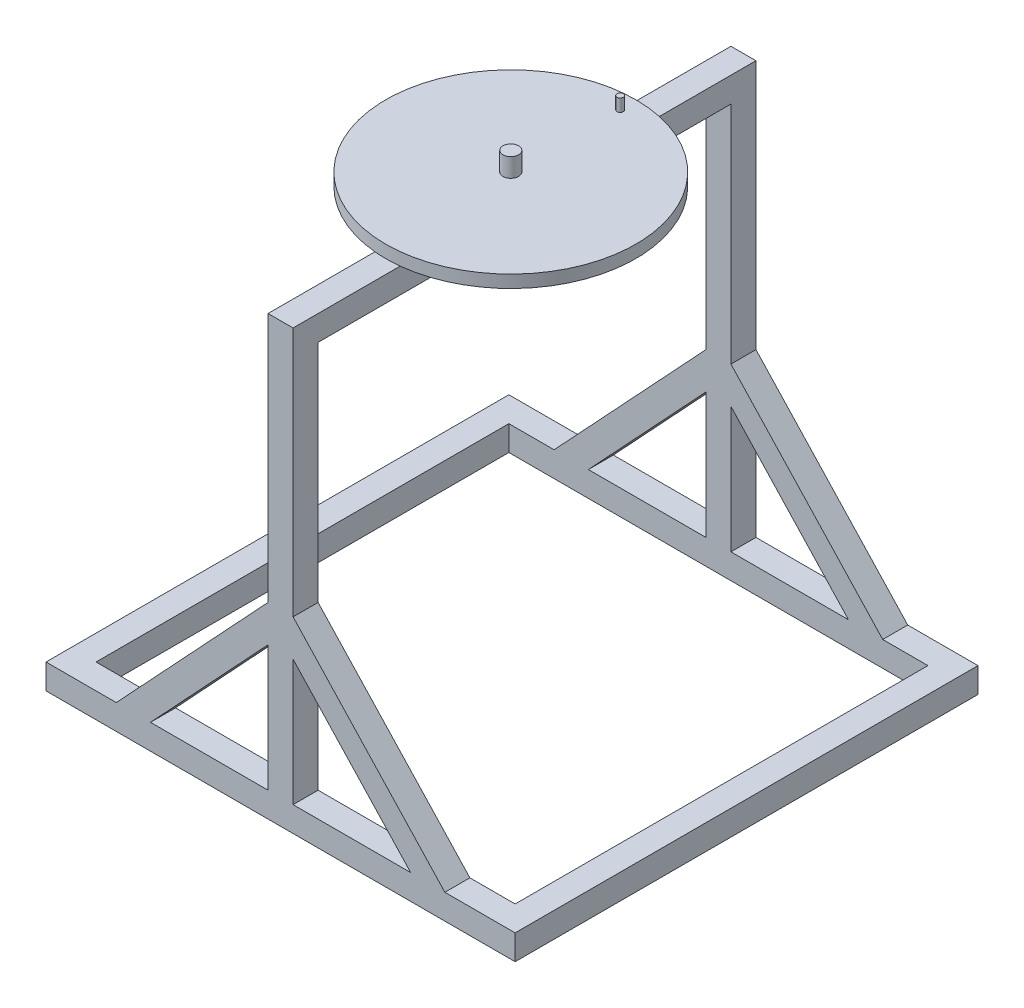
ISO-10303-21;
HEADER;
FILE_DESCRIPTION(('STEP AP214'),'2;1');
FILE_NAME('part.step','',(''),(''),'','','');
FILE_SCHEMA(('AUTOMOTIVE_DESIGN { 1 0 10303 214 1 1 1 1 }'));
ENDSEC;
DATA;
#1=APPLICATION_CONTEXT('core data for automotive mechanical design processes');
#2=APPLICATION_PROTOCOL_DEFINITION('international standard','automotive_design',2000,#1);
#3=PRODUCT_CONTEXT('',#1,'mechanical');
#4=PRODUCT('Part','Part','',(#3));
#5=PRODUCT_RELATED_PRODUCT_CATEGORY('part','',(#4));
#6=PRODUCT_DEFINITION_FORMATION('','',#4);
#7=PRODUCT_DEFINITION_CONTEXT('part definition',#1,'design');
#8=PRODUCT_DEFINITION('design','',#6,#7);
#9=PRODUCT_DEFINITION_SHAPE('','',#8);
#10=(LENGTH_UNIT() NAMED_UNIT(*) SI_UNIT(.MILLI.,.METRE.));
#11=(NAMED_UNIT(*) PLANE_ANGLE_UNIT() SI_UNIT($,.RADIAN.));
#12=(NAMED_UNIT(*) SI_UNIT($,.STERADIAN.) SOLID_ANGLE_UNIT());
#13=UNCERTAINTY_MEASURE_WITH_UNIT(LENGTH_MEASURE(1.E-05),#10,'distance_accuracy_value','');
#14=(GEOMETRIC_REPRESENTATION_CONTEXT(3) GLOBAL_UNCERTAINTY_ASSIGNED_CONTEXT((#13)) GLOBAL_UNIT_ASSIGNED_CONTEXT((#10,
#11,#12)) REPRESENTATION_CONTEXT('',''));
#15=CARTESIAN_POINT('',(0.,0.,0.));
#16=DIRECTION('',(0.,0.,1.));
#17=DIRECTION('',(1.,0.,0.));
#18=AXIS2_PLACEMENT_3D('',#15,#16,#17);
#19=CARTESIAN_POINT('',(0.,173.509933774834,740.));
#20=DIRECTION('',(0.,1.,0.));
#21=DIRECTION('',(0.,0.,1.));
#22=AXIS2_PLACEMENT_3D('',#19,#20,#21);
#23=PLANE('',#22);
#24=CARTESIAN_POINT('',(-61.4033289403528,173.509933774834,370.));
#25=DIRECTION('',(0.,1.,0.));
#26=DIRECTION('',(0.,0.,1.));
#27=AXIS2_PLACEMENT_3D('',#24,#25,#26);
#28=CIRCLE('',#27,200.);
#29=CARTESIAN_POINT('',(-39.4701986754966,173.509933774834,171.206293367258));
#30=VERTEX_POINT('',#29);
#31=CARTESIAN_POINT('',(-79.4701986754966,173.509933774834,170.817701042554));
#32=VERTEX_POINT('',#31);
#33=EDGE_CURVE('E11',#30,#32,#28,.T.);
#34=ORIENTED_EDGE('',*,*,#33,.F.);
#35=DIRECTION('',(0.,0.,-1.));
#36=VECTOR('',#35,1.);
#37=CARTESIAN_POINT('',(-39.4701986754966,173.509933774834,740.));
#38=LINE('',#37,#36);
#39=CARTESIAN_POINT('',(-39.4701986754966,173.509933774834,0.));
#40=VERTEX_POINT('',#39);
#41=EDGE_CURVE('E266',#30,#40,#38,.T.);
#42=ORIENTED_EDGE('',*,*,#41,.T.);
#43=DIRECTION('',(1.,0.,0.));
#44=VECTOR('',#43,1.);
#45=CARTESIAN_POINT('',(0.,173.509933774834,0.));
#46=LINE('',#45,#44);
#47=CARTESIAN_POINT('',(-79.4701986754966,173.509933774834,0.));
#48=VERTEX_POINT('',#47);
#49=EDGE_CURVE('E425',#48,#40,#46,.T.);
#50=ORIENTED_EDGE('',*,*,#49,.F.);
#51=DIRECTION('',(0.,0.,-1.));
#52=VECTOR('',#51,1.);
#53=CARTESIAN_POINT('',(-79.4701986754966,173.509933774834,740.));
#54=LINE('',#53,#52);
#55=EDGE_CURVE('E55',#32,#48,#54,.T.);
#56=ORIENTED_EDGE('',*,*,#55,.F.);
#57=EDGE_LOOP('',(#34,#42,#50,#56));
#58=FACE_BOUND('',#57,.T.);
#59=ADVANCED_FACE('F34',(#58),#23,.T.);
#60=CARTESIAN_POINT('',(0.,-486.490066225165,740.));
#61=DIRECTION('',(0.,-1.,0.));
#62=DIRECTION('',(0.,0.,-1.));
#63=AXIS2_PLACEMENT_3D('',#60,#61,#62);
#64=PLANE('',#63);
#65=DIRECTION('',(0.,0.,-1.));
#66=VECTOR('',#65,1.);
#67=CARTESIAN_POINT('',(-79.4701986754965,-486.490066225165,740.));
#68=LINE('',#67,#66);
#69=CARTESIAN_POINT('',(-79.4701986754965,-486.490066225165,740.));
#70=VERTEX_POINT('',#69);
#71=CARTESIAN_POINT('',(-79.4701986754965,-486.490066225165,700.));
#72=VERTEX_POINT('',#71);
#73=EDGE_CURVE('E459',#70,#72,#68,.T.);
#74=ORIENTED_EDGE('',*,*,#73,.T.);
#75=DIRECTION('',(-1.,0.,0.));
#76=VECTOR('',#75,1.);
#77=CARTESIAN_POINT('',(0.,-486.490066225165,700.));
#78=LINE('',#77,#76);
#79=CARTESIAN_POINT('',(-267.421439932341,-486.490066225165,700.));
#80=VERTEX_POINT('',#79);
#81=EDGE_CURVE('E365',#72,#80,#78,.T.);
#82=ORIENTED_EDGE('',*,*,#81,.T.);
#83=DIRECTION('',(0.,0.,-1.));
#84=VECTOR('',#83,1.);
#85=CARTESIAN_POINT('',(-267.421439932341,-486.490066225165,740.));
#86=LINE('',#85,#84);
#87=CARTESIAN_POINT('',(-267.421439932341,-486.490066225165,740.));
#88=VERTEX_POINT('',#87);
#89=EDGE_CURVE('E468',#88,#80,#86,.T.);
#90=ORIENTED_EDGE('',*,*,#89,.F.);
#91=DIRECTION('',(-1.,0.,0.));
#92=VECTOR('',#91,1.);
#93=CARTESIAN_POINT('',(0.,-486.490066225165,740.));
#94=LINE('',#93,#92);
#95=EDGE_CURVE('E416',#70,#88,#94,.T.);
#96=ORIENTED_EDGE('',*,*,#95,.F.);
#97=EDGE_LOOP('',(#74,#82,#90,#96));
#98=FACE_BOUND('',#97,.T.);
#99=ADVANCED_FACE('F597',(#98),#64,.F.);
#100=CARTESIAN_POINT('',(99.7460568230592,-93.096319701522,740.));
#101=DIRECTION('',(-0.731055268242869,0.682318250360011,0.));
#102=DIRECTION('',(-0.682318250360011,-0.731055268242869,0.));
#103=AXIS2_PLACEMENT_3D('',#100,#101,#102);
#104=PLANE('',#103);
#105=ORIENTED_EDGE('',*,*,#89,.T.);
#106=DIRECTION('',(0.682318250360011,0.731055268242869,0.));
#107=VECTOR('',#106,1.);
#108=CARTESIAN_POINT('',(99.7460568230592,-93.096319701522,700.));
#109=LINE('',#108,#107);
#110=CARTESIAN_POINT('',(-79.4701986754965,-285.113736307117,700.));
#111=VERTEX_POINT('',#110);
#112=EDGE_CURVE('E362',#80,#111,#109,.T.);
#113=ORIENTED_EDGE('',*,*,#112,.T.);
#114=DIRECTION('',(0.,0.,-1.));
#115=VECTOR('',#114,1.);
#116=CARTESIAN_POINT('',(-79.4701986754965,-285.113736307117,740.));
#117=LINE('',#116,#115);
#118=CARTESIAN_POINT('',(-79.4701986754965,-285.113736307117,740.));
#119=VERTEX_POINT('',#118);
#120=EDGE_CURVE('E464',#119,#111,#117,.T.);
#121=ORIENTED_EDGE('',*,*,#120,.F.);
#122=DIRECTION('',(0.682318250360011,0.731055268242869,0.));
#123=VECTOR('',#122,1.);
#124=CARTESIAN_POINT('',(99.7460568230592,-93.096319701522,740.));
#125=LINE('',#124,#123);
#126=EDGE_CURVE('E419',#88,#119,#125,.T.);
#127=ORIENTED_EDGE('',*,*,#126,.F.);
#128=EDGE_LOOP('',(#105,#113,#121,#127));
#129=FACE_BOUND('',#128,.T.);
#130=ADVANCED_FACE('F601',(#129),#104,.F.);
#131=CARTESIAN_POINT('',(-163.31277749758,-152.425258997742,740.));
#132=DIRECTION('',(-0.731055268242869,-0.682318250360011,0.));
#133=DIRECTION('',(0.682318250360011,-0.731055268242869,0.));
#134=AXIS2_PLACEMENT_3D('',#131,#132,#133);
#135=PLANE('',#134);
#136=DIRECTION('',(-0.682318250360011,0.731055268242869,0.));
#137=VECTOR('',#136,1.);
#138=CARTESIAN_POINT('',(-163.31277749758,-152.425258997742,700.));
#139=LINE('',#138,#137);
#140=CARTESIAN_POINT('',(148.481042581348,-486.490066225165,700.));
#141=VERTEX_POINT('',#140);
#142=CARTESIAN_POINT('',(-39.4701986754965,-285.113736307117,700.));
#143=VERTEX_POINT('',#142);
#144=EDGE_CURVE('E387',#141,#143,#139,.T.);
#145=ORIENTED_EDGE('',*,*,#144,.F.);
#146=DIRECTION('',(0.,0.,-1.));
#147=VECTOR('',#146,1.);
#148=CARTESIAN_POINT('',(148.481042581348,-486.490066225165,740.));
#149=LINE('',#148,#147);
#150=CARTESIAN_POINT('',(148.481042581348,-486.490066225165,740.));
#151=VERTEX_POINT('',#150);
#152=EDGE_CURVE('E480',#151,#141,#149,.T.);
#153=ORIENTED_EDGE('',*,*,#152,.F.);
#154=DIRECTION('',(-0.682318250360011,0.731055268242869,0.));
#155=VECTOR('',#154,1.);
#156=CARTESIAN_POINT('',(-163.31277749758,-152.425258997742,740.));
#157=LINE('',#156,#155);
#158=CARTESIAN_POINT('',(-39.4701986754965,-285.113736307117,740.));
#159=VERTEX_POINT('',#158);
#160=EDGE_CURVE('E408',#151,#159,#157,.T.);
#161=ORIENTED_EDGE('',*,*,#160,.T.);
#162=DIRECTION('',(0.,0.,-1.));
#163=VECTOR('',#162,1.);
#164=CARTESIAN_POINT('',(-39.4701986754965,-285.113736307117,740.));
#165=LINE('',#164,#163);
#166=EDGE_CURVE('E472',#159,#143,#165,.T.);
#167=ORIENTED_EDGE('',*,*,#166,.T.);
#168=EDGE_LOOP('',(#145,#153,#161,#167));
#169=FACE_BOUND('',#168,.T.);
#170=ADVANCED_FACE('F625',(#169),#135,.T.);
#171=CARTESIAN_POINT('',(0.,-486.490066225165,740.));
#172=DIRECTION('',(0.,-1.,0.));
#173=DIRECTION('',(0.,0.,-1.));
#174=AXIS2_PLACEMENT_3D('',#171,#172,#173);
#175=PLANE('',#174);
#176=ORIENTED_EDGE('',*,*,#152,.T.);
#177=DIRECTION('',(-1.,0.,0.));
#178=VECTOR('',#177,1.);
#179=CARTESIAN_POINT('',(0.,-486.490066225165,700.));
#180=LINE('',#179,#178);
#181=CARTESIAN_POINT('',(-39.4701986754965,-486.490066225165,700.));
#182=VERTEX_POINT('',#181);
#183=EDGE_CURVE('E384',#141,#182,#180,.T.);
#184=ORIENTED_EDGE('',*,*,#183,.T.);
#185=DIRECTION('',(0.,0.,-1.));
#186=VECTOR('',#185,1.);
#187=CARTESIAN_POINT('',(-39.4701986754965,-486.490066225165,740.));
#188=LINE('',#187,#186);
#189=CARTESIAN_POINT('',(-39.4701986754965,-486.490066225165,740.));
#190=VERTEX_POINT('',#189);
#191=EDGE_CURVE('E476',#190,#182,#188,.T.);
#192=ORIENTED_EDGE('',*,*,#191,.F.);
#193=DIRECTION('',(-1.,0.,0.));
#194=VECTOR('',#193,1.);
#195=CARTESIAN_POINT('',(0.,-486.490066225165,740.));
#196=LINE('',#195,#194);
#197=EDGE_CURVE('E411',#151,#190,#196,.T.);
#198=ORIENTED_EDGE('',*,*,#197,.F.);
#199=EDGE_LOOP('',(#176,#184,#192,#198));
#200=FACE_BOUND('',#199,.T.);
#201=ADVANCED_FACE('F618',(#200),#175,.F.);
#202=CARTESIAN_POINT('',(70.5038460933445,-65.8035896871215,740.));
#203=DIRECTION('',(-0.731055268242869,0.682318250360011,0.));
#204=DIRECTION('',(-0.682318250360011,-0.731055268242869,0.));
#205=AXIS2_PLACEMENT_3D('',#202,#203,#204);
#206=PLANE('',#205);
#207=DIRECTION('',(0.682318250360011,0.731055268242869,0.));
#208=VECTOR('',#207,1.);
#209=CARTESIAN_POINT('',(70.5038460933445,-65.8035896871215,700.));
#210=LINE('',#209,#208);
#211=CARTESIAN_POINT('',(-322.136865342163,-486.490066225165,700.));
#212=VERTEX_POINT('',#211);
#213=CARTESIAN_POINT('',(-79.4701986754965,-226.490066225165,700.));
#214=VERTEX_POINT('',#213);
#215=EDGE_CURVE('E377',#212,#214,#210,.T.);
#216=ORIENTED_EDGE('',*,*,#215,.F.);
#217=DIRECTION('',(0.,0.,-1.));
#218=VECTOR('',#217,1.);
#219=CARTESIAN_POINT('',(-322.136865342163,-486.490066225165,740.));
#220=LINE('',#219,#218);
#221=CARTESIAN_POINT('',(-322.136865342163,-486.490066225165,740.));
#222=VERTEX_POINT('',#221);
#223=EDGE_CURVE('E491',#222,#212,#220,.T.);
#224=ORIENTED_EDGE('',*,*,#223,.F.);
#225=DIRECTION('',(0.682318250360011,0.731055268242869,0.));
#226=VECTOR('',#225,1.);
#227=CARTESIAN_POINT('',(70.5038460933445,-65.8035896871215,740.));
#228=LINE('',#227,#226);
#229=CARTESIAN_POINT('',(-79.4701986754965,-226.490066225165,740.));
#230=VERTEX_POINT('',#229);
#231=EDGE_CURVE('E396',#222,#230,#228,.T.);
#232=ORIENTED_EDGE('',*,*,#231,.T.);
#233=DIRECTION('',(0.,0.,-1.));
#234=VECTOR('',#233,1.);
#235=CARTESIAN_POINT('',(-79.4701986754965,-226.490066225165,740.));
#236=LINE('',#235,#234);
#237=EDGE_CURVE('E495',#230,#214,#236,.T.);
#238=ORIENTED_EDGE('',*,*,#237,.T.);
#239=EDGE_LOOP('',(#216,#224,#232,#238));
#240=FACE_BOUND('',#239,.T.);
#241=ADVANCED_FACE('F576',(#240),#206,.T.);
#242=CARTESIAN_POINT('',(-39.4701986754966,0.,740.));
#243=DIRECTION('',(1.,0.,0.));
#244=DIRECTION('',(0.,1.,0.));
#245=AXIS2_PLACEMENT_3D('',#242,#243,#244);
#246=PLANE('',#245);
#247=DIRECTION('',(0.,-1.,0.));
#248=VECTOR('',#247,1.);
#249=CARTESIAN_POINT('',(-39.4701986754966,0.,700.));
#250=LINE('',#249,#248);
#251=EDGE_CURVE('E382',#143,#182,#250,.T.);
#252=ORIENTED_EDGE('',*,*,#251,.F.);
#253=ORIENTED_EDGE('',*,*,#166,.F.);
#254=DIRECTION('',(0.,-1.,0.));
#255=VECTOR('',#254,1.);
#256=CARTESIAN_POINT('',(-39.4701986754966,0.,740.));
#257=LINE('',#256,#255);
#258=EDGE_CURVE('E413',#159,#190,#257,.T.);
#259=ORIENTED_EDGE('',*,*,#258,.T.);
#260=ORIENTED_EDGE('',*,*,#191,.T.);
#261=EDGE_LOOP('',(#252,#253,#259,#260));
#262=FACE_BOUND('',#261,.T.);
#263=ADVANCED_FACE('F634',(#262),#246,.T.);
#264=CARTESIAN_POINT('',(-134.070566767866,-125.132528983341,740.));
#265=DIRECTION('',(-0.731055268242869,-0.682318250360011,0.));
#266=DIRECTION('',(0.682318250360011,-0.731055268242869,0.));
#267=AXIS2_PLACEMENT_3D('',#264,#265,#266);
#268=PLANE('',#267);
#269=DIRECTION('',(0.,0.,-1.));
#270=VECTOR('',#269,1.);
#271=CARTESIAN_POINT('',(203.19646799117,-486.490066225165,740.));
#272=LINE('',#271,#270);
#273=CARTESIAN_POINT('',(203.19646799117,-486.490066225165,740.));
#274=VERTEX_POINT('',#273);
#275=CARTESIAN_POINT('',(203.19646799117,-486.490066225165,700.));
#276=VERTEX_POINT('',#275);
#277=EDGE_CURVE('E487',#274,#276,#272,.T.);
#278=ORIENTED_EDGE('',*,*,#277,.T.);
#279=DIRECTION('',(-0.682318250360011,0.731055268242869,0.));
#280=VECTOR('',#279,1.);
#281=CARTESIAN_POINT('',(-134.070566767866,-125.132528983341,700.));
#282=LINE('',#281,#280);
#283=CARTESIAN_POINT('',(-39.4701986754966,-226.490066225165,700.));
#284=VERTEX_POINT('',#283);
#285=EDGE_CURVE('E368',#276,#284,#282,.T.);
#286=ORIENTED_EDGE('',*,*,#285,.T.);
#287=DIRECTION('',(0.,0.,-1.));
#288=VECTOR('',#287,1.);
#289=CARTESIAN_POINT('',(-39.4701986754966,-226.490066225165,740.));
#290=LINE('',#289,#288);
#291=CARTESIAN_POINT('',(-39.4701986754966,-226.490066225165,740.));
#292=VERTEX_POINT('',#291);
#293=EDGE_CURVE('E483',#292,#284,#290,.T.);
#294=ORIENTED_EDGE('',*,*,#293,.F.);
#295=DIRECTION('',(-0.682318250360011,0.731055268242869,0.));
#296=VECTOR('',#295,1.);
#297=CARTESIAN_POINT('',(-134.070566767866,-125.132528983341,740.));
#298=LINE('',#297,#296);
#299=EDGE_CURVE('E405',#274,#292,#298,.T.);
#300=ORIENTED_EDGE('',*,*,#299,.F.);
#301=EDGE_LOOP('',(#278,#286,#294,#300));
#302=FACE_BOUND('',#301,.T.);
#303=ADVANCED_FACE('F585',(#302),#268,.F.);
#304=CARTESIAN_POINT('',(-79.4701986754966,0.,740.));
#305=DIRECTION('',(1.,0.,0.));
#306=DIRECTION('',(0.,1.,0.));
#307=AXIS2_PLACEMENT_3D('',#304,#305,#306);
#308=PLANE('',#307);
#309=ORIENTED_EDGE('',*,*,#120,.T.);
#310=DIRECTION('',(0.,-1.,0.));
#311=VECTOR('',#310,1.);
#312=CARTESIAN_POINT('',(-79.4701986754966,0.,700.));
#313=LINE('',#312,#311);
#314=EDGE_CURVE('E503',#111,#72,#313,.T.);
#315=ORIENTED_EDGE('',*,*,#314,.T.);
#316=ORIENTED_EDGE('',*,*,#73,.F.);
#317=DIRECTION('',(0.,-1.,0.));
#318=VECTOR('',#317,1.);
#319=CARTESIAN_POINT('',(-79.4701986754966,0.,740.));
#320=LINE('',#319,#318);
#321=EDGE_CURVE('E421',#119,#70,#320,.T.);
#322=ORIENTED_EDGE('',*,*,#321,.F.);
#323=EDGE_LOOP('',(#309,#315,#316,#322));
#324=FACE_BOUND('',#323,.T.);
#325=ADVANCED_FACE('F656',(#324),#308,.F.);
#326=CARTESIAN_POINT('',(-267.421439932341,-486.490066225165,40.));
#327=VERTEX_POINT('',#326);
#328=CARTESIAN_POINT('',(-267.421439932341,-486.490066225165,0.));
#329=VERTEX_POINT('',#328);
#330=EDGE_CURVE('E467',#327,#329,#86,.T.);
#331=ORIENTED_EDGE('',*,*,#330,.F.);
#332=DIRECTION('',(1.,0.,0.));
#333=VECTOR('',#332,1.);
#334=CARTESIAN_POINT('',(0.,-486.490066225165,40.));
#335=LINE('',#334,#333);
#336=CARTESIAN_POINT('',(-79.4701986754965,-486.490066225165,40.));
#337=VERTEX_POINT('',#336);
#338=EDGE_CURVE('E336',#327,#337,#335,.T.);
#339=ORIENTED_EDGE('',*,*,#338,.T.);
#340=CARTESIAN_POINT('',(-79.4701986754965,-486.490066225165,0.));
#341=VERTEX_POINT('',#340);
#342=EDGE_CURVE('E463',#337,#341,#68,.T.);
#343=ORIENTED_EDGE('',*,*,#342,.T.);
#344=DIRECTION('',(-1.,0.,0.));
#345=VECTOR('',#344,1.);
#346=CARTESIAN_POINT('',(0.,-486.490066225165,0.));
#347=LINE('',#346,#345);
#348=EDGE_CURVE('E451',#341,#329,#347,.T.);
#349=ORIENTED_EDGE('',*,*,#348,.T.);
#350=EDGE_LOOP('',(#331,#339,#343,#349));
#351=FACE_BOUND('',#350,.T.);
#352=ADVANCED_FACE('F604',(#351),#64,.F.);
#353=CARTESIAN_POINT('',(-79.4701986754965,-285.113736307117,40.));
#354=VERTEX_POINT('',#353);
#355=CARTESIAN_POINT('',(-79.4701986754965,-285.113736307117,0.));
#356=VERTEX_POINT('',#355);
#357=EDGE_CURVE('E462',#354,#356,#117,.T.);
#358=ORIENTED_EDGE('',*,*,#357,.F.);
#359=DIRECTION('',(-0.682318250360011,-0.731055268242869,0.));
#360=VECTOR('',#359,1.);
#361=CARTESIAN_POINT('',(99.7460568230592,-93.096319701522,40.));
#362=LINE('',#361,#360);
#363=EDGE_CURVE('E333',#354,#327,#362,.T.);
#364=ORIENTED_EDGE('',*,*,#363,.T.);
#365=ORIENTED_EDGE('',*,*,#330,.T.);
#366=DIRECTION('',(0.682318250360011,0.731055268242869,0.));
#367=VECTOR('',#366,1.);
#368=CARTESIAN_POINT('',(99.7460568230592,-93.096319701522,0.));
#369=LINE('',#368,#367);
#370=EDGE_CURVE('E454',#329,#356,#369,.T.);
#371=ORIENTED_EDGE('',*,*,#370,.T.);
#372=EDGE_LOOP('',(#358,#364,#365,#371));
#373=FACE_BOUND('',#372,.T.);
#374=ADVANCED_FACE('F622',(#373),#104,.F.);
#375=DIRECTION('',(0.682318250360011,-0.731055268242869,0.));
#376=VECTOR('',#375,1.);
#377=CARTESIAN_POINT('',(-163.31277749758,-152.425258997742,40.));
#378=LINE('',#377,#376);
#379=CARTESIAN_POINT('',(-39.4701986754965,-285.113736307117,40.));
#380=VERTEX_POINT('',#379);
#381=CARTESIAN_POINT('',(148.481042581348,-486.490066225165,40.));
#382=VERTEX_POINT('',#381);
#383=EDGE_CURVE('E360',#380,#382,#378,.T.);
#384=ORIENTED_EDGE('',*,*,#383,.F.);
#385=CARTESIAN_POINT('',(-39.4701986754965,-285.113736307117,0.));
#386=VERTEX_POINT('',#385);
#387=EDGE_CURVE('E263',#380,#386,#165,.T.);
#388=ORIENTED_EDGE('',*,*,#387,.T.);
#389=DIRECTION('',(-0.682318250360011,0.731055268242869,0.));
#390=VECTOR('',#389,1.);
#391=CARTESIAN_POINT('',(-163.31277749758,-152.425258997742,0.));
#392=LINE('',#391,#390);
#393=CARTESIAN_POINT('',(148.481042581348,-486.490066225165,0.));
#394=VERTEX_POINT('',#393);
#395=EDGE_CURVE('E442',#394,#386,#392,.T.);
#396=ORIENTED_EDGE('',*,*,#395,.F.);
#397=EDGE_CURVE('E479',#382,#394,#149,.T.);
#398=ORIENTED_EDGE('',*,*,#397,.F.);
#399=EDGE_LOOP('',(#384,#388,#396,#398));
#400=FACE_BOUND('',#399,.T.);
#401=ADVANCED_FACE('F615',(#400),#135,.T.);
#402=CARTESIAN_POINT('',(-39.4701986754965,-486.490066225165,40.));
#403=VERTEX_POINT('',#402);
#404=CARTESIAN_POINT('',(-39.4701986754965,-486.490066225165,0.));
#405=VERTEX_POINT('',#404);
#406=EDGE_CURVE('E475',#403,#405,#188,.T.);
#407=ORIENTED_EDGE('',*,*,#406,.F.);
#408=DIRECTION('',(1.,0.,0.));
#409=VECTOR('',#408,1.);
#410=CARTESIAN_POINT('',(0.,-486.490066225165,40.));
#411=LINE('',#410,#409);
#412=EDGE_CURVE('E357',#403,#382,#411,.T.);
#413=ORIENTED_EDGE('',*,*,#412,.T.);
#414=ORIENTED_EDGE('',*,*,#397,.T.);
#415=DIRECTION('',(-1.,0.,0.));
#416=VECTOR('',#415,1.);
#417=CARTESIAN_POINT('',(0.,-486.490066225165,0.));
#418=LINE('',#417,#416);
#419=EDGE_CURVE('E445',#394,#405,#418,.T.);
#420=ORIENTED_EDGE('',*,*,#419,.T.);
#421=EDGE_LOOP('',(#407,#413,#414,#420));
#422=FACE_BOUND('',#421,.T.);
#423=ADVANCED_FACE('F611',(#422),#175,.F.);
#424=CARTESIAN_POINT('',(-39.4701986754966,0.,740.));
#425=DIRECTION('',(1.,0.,0.));
#426=DIRECTION('',(0.,1.,0.));
#427=AXIS2_PLACEMENT_3D('',#424,#425,#426);
#428=PLANE('',#427);
#429=CARTESIAN_POINT('',(-39.4701986754966,-226.490066225165,40.));
#430=VERTEX_POINT('',#429);
#431=CARTESIAN_POINT('',(-39.4701986754966,-226.490066225165,0.));
#432=VERTEX_POINT('',#431);
#433=EDGE_CURVE('E423',#430,#432,#290,.T.);
#434=ORIENTED_EDGE('',*,*,#433,.T.);
#435=DIRECTION('',(0.,-1.,0.));
#436=VECTOR('',#435,1.);
#437=CARTESIAN_POINT('',(-39.4701986754966,0.,0.));
#438=LINE('',#437,#436);
#439=EDGE_CURVE('E389',#40,#432,#438,.T.);
#440=ORIENTED_EDGE('',*,*,#439,.F.);
#441=ORIENTED_EDGE('',*,*,#41,.F.);
#442=CARTESIAN_POINT('',(-39.4701986754966,173.509933774834,568.793706632742));
#443=VERTEX_POINT('',#442);
#444=EDGE_CURVE('E264',#443,#30,#38,.T.);
#445=ORIENTED_EDGE('',*,*,#444,.F.);
#446=CARTESIAN_POINT('',(-39.4701986754966,173.509933774834,740.));
#447=VERTEX_POINT('',#446);
#448=EDGE_CURVE('E254',#447,#443,#38,.T.);
#449=ORIENTED_EDGE('',*,*,#448,.F.);
#450=DIRECTION('',(0.,-1.,0.));
#451=VECTOR('',#450,1.);
#452=CARTESIAN_POINT('',(-39.4701986754966,0.,740.));
#453=LINE('',#452,#451);
#454=EDGE_CURVE('E390',#447,#292,#453,.T.);
#455=ORIENTED_EDGE('',*,*,#454,.T.);
#456=ORIENTED_EDGE('',*,*,#293,.T.);
#457=DIRECTION('',(0.,-1.,0.));
#458=VECTOR('',#457,1.);
#459=CARTESIAN_POINT('',(-39.4701986754966,0.,700.));
#460=LINE('',#459,#458);
#461=CARTESIAN_POINT('',(-39.4701986754966,133.509933774834,700.));
#462=VERTEX_POINT('',#461);
#463=EDGE_CURVE('E373',#462,#284,#460,.T.);
#464=ORIENTED_EDGE('',*,*,#463,.F.);
#465=DIRECTION('',(0.,0.,-1.));
#466=VECTOR('',#465,1.);
#467=CARTESIAN_POINT('',(-39.4701986754966,133.509933774834,740.));
#468=LINE('',#467,#466);
#469=CARTESIAN_POINT('',(-39.4701986754966,133.509933774834,40.));
#470=VERTEX_POINT('',#469);
#471=EDGE_CURVE('E281',#462,#470,#468,.T.);
#472=ORIENTED_EDGE('',*,*,#471,.T.);
#473=DIRECTION('',(0.,1.,0.));
#474=VECTOR('',#473,1.);
#475=CARTESIAN_POINT('',(-39.4701986754966,0.,40.));
#476=LINE('',#475,#474);
#477=EDGE_CURVE('E345',#430,#470,#476,.T.);
#478=ORIENTED_EDGE('',*,*,#477,.F.);
#479=EDGE_LOOP('',(#434,#440,#441,#445,#449,#455,#456,#464,#472,#478));
#480=FACE_BOUND('',#479,.T.);
#481=ADVANCED_FACE('F36',(#480),#428,.T.);
#482=CARTESIAN_POINT('',(-79.4701986754966,173.509933774834,569.182298957446));
#483=VERTEX_POINT('',#482);
#484=EDGE_CURVE('E43',#483,#443,#28,.T.);
#485=ORIENTED_EDGE('',*,*,#484,.F.);
#486=CARTESIAN_POINT('',(-79.4701986754966,173.509933774834,740.));
#487=VERTEX_POINT('',#486);
#488=EDGE_CURVE('E498',#487,#483,#54,.T.);
#489=ORIENTED_EDGE('',*,*,#488,.F.);
#490=DIRECTION('',(1.,0.,0.));
#491=VECTOR('',#490,1.);
#492=CARTESIAN_POINT('',(0.,173.509933774834,740.));
#493=LINE('',#492,#491);
#494=EDGE_CURVE('E260',#487,#447,#493,.T.);
#495=ORIENTED_EDGE('',*,*,#494,.T.);
#496=ORIENTED_EDGE('',*,*,#448,.T.);
#497=EDGE_LOOP('',(#485,#489,#495,#496));
#498=FACE_BOUND('',#497,.T.);
#499=ADVANCED_FACE('F256',(#498),#23,.T.);
#500=CARTESIAN_POINT('',(-79.4701986754966,0.,740.));
#501=DIRECTION('',(1.,0.,0.));
#502=DIRECTION('',(0.,1.,0.));
#503=AXIS2_PLACEMENT_3D('',#500,#501,#502);
#504=PLANE('',#503);
#505=DIRECTION('',(0.,1.,0.));
#506=VECTOR('',#505,1.);
#507=CARTESIAN_POINT('',(-79.4701986754966,0.,40.));
#508=LINE('',#507,#506);
#509=CARTESIAN_POINT('',(-79.4701986754965,-226.490066225165,40.));
#510=VERTEX_POINT('',#509);
#511=CARTESIAN_POINT('',(-79.4701986754966,133.509933774834,40.));
#512=VERTEX_POINT('',#511);
#513=EDGE_CURVE('E348',#510,#512,#508,.T.);
#514=ORIENTED_EDGE('',*,*,#513,.T.);
#515=DIRECTION('',(0.,0.,-1.));
#516=VECTOR('',#515,1.);
#517=CARTESIAN_POINT('',(-79.4701986754966,133.509933774834,740.));
#518=LINE('',#517,#516);
#519=CARTESIAN_POINT('',(-79.4701986754966,133.509933774834,700.));
#520=VERTEX_POINT('',#519);
#521=EDGE_CURVE('E286',#520,#512,#518,.T.);
#522=ORIENTED_EDGE('',*,*,#521,.F.);
#523=DIRECTION('',(0.,-1.,0.));
#524=VECTOR('',#523,1.);
#525=CARTESIAN_POINT('',(-79.4701986754966,0.,700.));
#526=LINE('',#525,#524);
#527=EDGE_CURVE('E375',#520,#214,#526,.T.);
#528=ORIENTED_EDGE('',*,*,#527,.T.);
#529=ORIENTED_EDGE('',*,*,#237,.F.);
#530=DIRECTION('',(0.,-1.,0.));
#531=VECTOR('',#530,1.);
#532=CARTESIAN_POINT('',(-79.4701986754966,0.,740.));
#533=LINE('',#532,#531);
#534=EDGE_CURVE('E394',#487,#230,#533,.T.);
#535=ORIENTED_EDGE('',*,*,#534,.F.);
#536=ORIENTED_EDGE('',*,*,#488,.T.);
#537=EDGE_CURVE('E499',#483,#32,#54,.T.);
#538=ORIENTED_EDGE('',*,*,#537,.T.);
#539=ORIENTED_EDGE('',*,*,#55,.T.);
#540=DIRECTION('',(0.,-1.,0.));
#541=VECTOR('',#540,1.);
#542=CARTESIAN_POINT('',(-79.4701986754966,0.,0.));
#543=LINE('',#542,#541);
#544=CARTESIAN_POINT('',(-79.4701986754965,-226.490066225165,0.));
#545=VERTEX_POINT('',#544);
#546=EDGE_CURVE('E428',#48,#545,#543,.T.);
#547=ORIENTED_EDGE('',*,*,#546,.T.);
#548=EDGE_CURVE('E494',#510,#545,#236,.T.);
#549=ORIENTED_EDGE('',*,*,#548,.F.);
#550=EDGE_LOOP('',(#514,#522,#528,#529,#535,#536,#538,#539,#547,#549));
#551=FACE_BOUND('',#550,.T.);
#552=ADVANCED_FACE('F520',(#551),#504,.F.);
#553=DIRECTION('',(-0.682318250360011,-0.731055268242869,0.));
#554=VECTOR('',#553,1.);
#555=CARTESIAN_POINT('',(70.5038460933445,-65.8035896871215,40.));
#556=LINE('',#555,#554);
#557=CARTESIAN_POINT('',(-322.136865342163,-486.490066225165,40.));
#558=VERTEX_POINT('',#557);
#559=EDGE_CURVE('E351',#510,#558,#556,.T.);
#560=ORIENTED_EDGE('',*,*,#559,.F.);
#561=ORIENTED_EDGE('',*,*,#548,.T.);
#562=DIRECTION('',(0.682318250360011,0.731055268242869,0.));
#563=VECTOR('',#562,1.);
#564=CARTESIAN_POINT('',(70.5038460933445,-65.8035896871215,0.));
#565=LINE('',#564,#563);
#566=CARTESIAN_POINT('',(-322.136865342163,-486.490066225165,0.));
#567=VERTEX_POINT('',#566);
#568=EDGE_CURVE('E430',#567,#545,#565,.T.);
#569=ORIENTED_EDGE('',*,*,#568,.F.);
#570=EDGE_CURVE('E490',#558,#567,#220,.T.);
#571=ORIENTED_EDGE('',*,*,#570,.F.);
#572=EDGE_LOOP('',(#560,#561,#569,#571));
#573=FACE_BOUND('',#572,.T.);
#574=ADVANCED_FACE('F526',(#573),#206,.T.);
#575=CARTESIAN_POINT('',(0.,-486.490066225165,740.));
#576=DIRECTION('',(0.,1.,0.));
#577=DIRECTION('',(0.,0.,1.));
#578=AXIS2_PLACEMENT_3D('',#575,#576,#577);
#579=PLANE('',#578);
#580=ORIENTED_EDGE('',*,*,#570,.T.);
#581=DIRECTION('',(1.,0.,0.));
#582=VECTOR('',#581,1.);
#583=CARTESIAN_POINT('',(0.,-486.490066225165,0.));
#584=LINE('',#583,#582);
#585=CARTESIAN_POINT('',(-434.470198675497,-486.490066225165,0.));
#586=VERTEX_POINT('',#585);
#587=EDGE_CURVE('E433',#586,#567,#584,.T.);
#588=ORIENTED_EDGE('',*,*,#587,.F.);
#589=DIRECTION('',(0.,0.,-1.));
#590=VECTOR('',#589,1.);
#591=CARTESIAN_POINT('',(-434.470198675497,-486.490066225165,817.));
#592=LINE('',#591,#590);
#593=CARTESIAN_POINT('',(-434.470198675497,-486.490066225165,740.));
#594=VERTEX_POINT('',#593);
#595=EDGE_CURVE('E321',#594,#586,#592,.T.);
#596=ORIENTED_EDGE('',*,*,#595,.F.);
#597=DIRECTION('',(1.,0.,0.));
#598=VECTOR('',#597,1.);
#599=CARTESIAN_POINT('',(0.,-486.490066225165,740.));
#600=LINE('',#599,#598);
#601=EDGE_CURVE('E399',#594,#222,#600,.T.);
#602=ORIENTED_EDGE('',*,*,#601,.T.);
#603=ORIENTED_EDGE('',*,*,#223,.T.);
#604=DIRECTION('',(1.,0.,0.));
#605=VECTOR('',#604,1.);
#606=CARTESIAN_POINT('',(0.,-486.490066225165,700.));
#607=LINE('',#606,#605);
#608=CARTESIAN_POINT('',(-394.470198675497,-486.490066225165,700.));
#609=VERTEX_POINT('',#608);
#610=EDGE_CURVE('E380',#609,#212,#607,.T.);
#611=ORIENTED_EDGE('',*,*,#610,.F.);
#612=DIRECTION('',(0.,0.,-1.));
#613=VECTOR('',#612,1.);
#614=CARTESIAN_POINT('',(-394.470198675497,-486.490066225165,740.));
#615=LINE('',#614,#613);
#616=CARTESIAN_POINT('',(-394.470198675497,-486.490066225165,40.));
#617=VERTEX_POINT('',#616);
#618=EDGE_CURVE('E293',#609,#617,#615,.T.);
#619=ORIENTED_EDGE('',*,*,#618,.T.);
#620=DIRECTION('',(-1.,0.,0.));
#621=VECTOR('',#620,1.);
#622=CARTESIAN_POINT('',(0.,-486.490066225165,40.));
#623=LINE('',#622,#621);
#624=EDGE_CURVE('E353',#558,#617,#623,.T.);
#625=ORIENTED_EDGE('',*,*,#624,.F.);
#626=EDGE_LOOP('',(#580,#588,#596,#602,#603,#611,#619,#625));
#627=FACE_BOUND('',#626,.T.);
#628=ADVANCED_FACE('F538',(#627),#579,.T.);
#629=CARTESIAN_POINT('',(0.,-526.490066225165,740.));
#630=DIRECTION('',(0.,1.,0.));
#631=DIRECTION('',(0.,0.,1.));
#632=AXIS2_PLACEMENT_3D('',#629,#630,#631);
#633=PLANE('',#632);
#634=DIRECTION('',(0.,0.,-1.));
#635=VECTOR('',#634,1.);
#636=CARTESIAN_POINT('',(-394.470198675497,-526.490066225165,740.));
#637=LINE('',#636,#635);
#638=CARTESIAN_POINT('',(-394.470198675497,-526.490066225165,700.));
#639=VERTEX_POINT('',#638);
#640=CARTESIAN_POINT('',(-394.470198675497,-526.490066225165,40.));
#641=VERTEX_POINT('',#640);
#642=EDGE_CURVE('E294',#639,#641,#637,.T.);
#643=ORIENTED_EDGE('',*,*,#642,.F.);
#644=DIRECTION('',(-1.,0.,0.));
#645=VECTOR('',#644,1.);
#646=CARTESIAN_POINT('',(-419.470198675497,-526.490066225165,700.));
#647=LINE('',#646,#645);
#648=CARTESIAN_POINT('',(275.529801324503,-526.490066225165,700.));
#649=VERTEX_POINT('',#648);
#650=EDGE_CURVE('E331',#649,#639,#647,.T.);
#651=ORIENTED_EDGE('',*,*,#650,.F.);
#652=DIRECTION('',(0.,0.,-1.));
#653=VECTOR('',#652,1.);
#654=CARTESIAN_POINT('',(275.529801324503,-526.490066225165,740.));
#655=LINE('',#654,#653);
#656=CARTESIAN_POINT('',(275.529801324503,-526.490066225165,40.));
#657=VERTEX_POINT('',#656);
#658=EDGE_CURVE('E301',#649,#657,#655,.T.);
#659=ORIENTED_EDGE('',*,*,#658,.T.);
#660=DIRECTION('',(1.,0.,0.));
#661=VECTOR('',#660,1.);
#662=CARTESIAN_POINT('',(-419.470198675496,-526.490066225165,40.));
#663=LINE('',#662,#661);
#664=EDGE_CURVE('E329',#641,#657,#663,.T.);
#665=ORIENTED_EDGE('',*,*,#664,.F.);
#666=EDGE_LOOP('',(#643,#651,#659,#665));
#667=FACE_BOUND('',#666,.T.);
#668=DIRECTION('',(0.,0.,-1.));
#669=VECTOR('',#668,1.);
#670=CARTESIAN_POINT('',(315.529801324503,-526.490066225165,817.));
#671=LINE('',#670,#669);
#672=CARTESIAN_POINT('',(315.529801324503,-526.490066225165,740.));
#673=VERTEX_POINT('',#672);
#674=CARTESIAN_POINT('',(315.529801324503,-526.490066225165,0.));
#675=VERTEX_POINT('',#674);
#676=EDGE_CURVE('E312',#673,#675,#671,.T.);
#677=ORIENTED_EDGE('',*,*,#676,.F.);
#678=DIRECTION('',(1.,0.,0.));
#679=VECTOR('',#678,1.);
#680=CARTESIAN_POINT('',(0.,-526.490066225165,740.));
#681=LINE('',#680,#679);
#682=CARTESIAN_POINT('',(-434.470198675497,-526.490066225165,740.));
#683=VERTEX_POINT('',#682);
#684=EDGE_CURVE('E401',#683,#673,#681,.T.);
#685=ORIENTED_EDGE('',*,*,#684,.F.);
#686=DIRECTION('',(0.,0.,-1.));
#687=VECTOR('',#686,1.);
#688=CARTESIAN_POINT('',(-434.470198675497,-526.490066225165,817.));
#689=LINE('',#688,#687);
#690=CARTESIAN_POINT('',(-434.470198675497,-526.490066225165,0.));
#691=VERTEX_POINT('',#690);
#692=EDGE_CURVE('E313',#683,#691,#689,.T.);
#693=ORIENTED_EDGE('',*,*,#692,.T.);
#694=DIRECTION('',(1.,0.,0.));
#695=VECTOR('',#694,1.);
#696=CARTESIAN_POINT('',(0.,-526.490066225165,0.));
#697=LINE('',#696,#695);
#698=EDGE_CURVE('E435',#691,#675,#697,.T.);
#699=ORIENTED_EDGE('',*,*,#698,.T.);
#700=EDGE_LOOP('',(#677,#685,#693,#699));
#701=FACE_BOUND('',#700,.T.);
#702=ADVANCED_FACE('F547',(#667,#701),#633,.F.);
#703=CARTESIAN_POINT('',(0.,-486.490066225165,740.));
#704=DIRECTION('',(0.,-1.,0.));
#705=DIRECTION('',(0.,0.,-1.));
#706=AXIS2_PLACEMENT_3D('',#703,#704,#705);
#707=PLANE('',#706);
#708=DIRECTION('',(1.,0.,0.));
#709=VECTOR('',#708,1.);
#710=CARTESIAN_POINT('',(0.,-486.490066225165,40.));
#711=LINE('',#710,#709);
#712=CARTESIAN_POINT('',(203.19646799117,-486.490066225165,40.));
#713=VERTEX_POINT('',#712);
#714=CARTESIAN_POINT('',(275.529801324503,-486.490066225165,40.));
#715=VERTEX_POINT('',#714);
#716=EDGE_CURVE('E342',#713,#715,#711,.T.);
#717=ORIENTED_EDGE('',*,*,#716,.T.);
#718=DIRECTION('',(0.,0.,-1.));
#719=VECTOR('',#718,1.);
#720=CARTESIAN_POINT('',(275.529801324504,-486.490066225165,740.));
#721=LINE('',#720,#719);
#722=CARTESIAN_POINT('',(275.529801324504,-486.490066225165,700.));
#723=VERTEX_POINT('',#722);
#724=EDGE_CURVE('E302',#723,#715,#721,.T.);
#725=ORIENTED_EDGE('',*,*,#724,.F.);
#726=DIRECTION('',(-1.,0.,0.));
#727=VECTOR('',#726,1.);
#728=CARTESIAN_POINT('',(0.,-486.490066225165,700.));
#729=LINE('',#728,#727);
#730=EDGE_CURVE('E371',#723,#276,#729,.T.);
#731=ORIENTED_EDGE('',*,*,#730,.T.);
#732=ORIENTED_EDGE('',*,*,#277,.F.);
#733=DIRECTION('',(-1.,0.,0.));
#734=VECTOR('',#733,1.);
#735=CARTESIAN_POINT('',(0.,-486.490066225165,740.));
#736=LINE('',#735,#734);
#737=CARTESIAN_POINT('',(315.529801324503,-486.490066225165,740.));
#738=VERTEX_POINT('',#737);
#739=EDGE_CURVE('E403',#738,#274,#736,.T.);
#740=ORIENTED_EDGE('',*,*,#739,.F.);
#741=DIRECTION('',(0.,0.,-1.));
#742=VECTOR('',#741,1.);
#743=CARTESIAN_POINT('',(315.529801324503,-486.490066225165,817.));
#744=LINE('',#743,#742);
#745=CARTESIAN_POINT('',(315.529801324503,-486.490066225165,0.));
#746=VERTEX_POINT('',#745);
#747=EDGE_CURVE('E314',#738,#746,#744,.T.);
#748=ORIENTED_EDGE('',*,*,#747,.T.);
#749=DIRECTION('',(-1.,0.,0.));
#750=VECTOR('',#749,1.);
#751=CARTESIAN_POINT('',(0.,-486.490066225165,0.));
#752=LINE('',#751,#750);
#753=CARTESIAN_POINT('',(203.19646799117,-486.490066225165,0.));
#754=VERTEX_POINT('',#753);
#755=EDGE_CURVE('E437',#746,#754,#752,.T.);
#756=ORIENTED_EDGE('',*,*,#755,.T.);
#757=EDGE_CURVE('E486',#713,#754,#272,.T.);
#758=ORIENTED_EDGE('',*,*,#757,.F.);
#759=EDGE_LOOP('',(#717,#725,#731,#732,#740,#748,#756,#758));
#760=FACE_BOUND('',#759,.T.);
#761=ADVANCED_FACE('F556',(#760),#707,.F.);
#762=DIRECTION('',(0.,1.,0.));
#763=VECTOR('',#762,1.);
#764=CARTESIAN_POINT('',(-39.4701986754966,0.,40.));
#765=LINE('',#764,#763);
#766=EDGE_CURVE('E355',#403,#380,#765,.T.);
#767=ORIENTED_EDGE('',*,*,#766,.F.);
#768=ORIENTED_EDGE('',*,*,#406,.T.);
#769=DIRECTION('',(0.,-1.,0.));
#770=VECTOR('',#769,1.);
#771=CARTESIAN_POINT('',(-39.4701986754966,0.,0.));
#772=LINE('',#771,#770);
#773=EDGE_CURVE('E448',#386,#405,#772,.T.);
#774=ORIENTED_EDGE('',*,*,#773,.F.);
#775=ORIENTED_EDGE('',*,*,#387,.F.);
#776=EDGE_LOOP('',(#767,#768,#774,#775));
#777=FACE_BOUND('',#776,.T.);
#778=ADVANCED_FACE('F676',(#777),#246,.T.);
#779=ORIENTED_EDGE('',*,*,#433,.F.);
#780=DIRECTION('',(0.682318250360011,-0.731055268242869,0.));
#781=VECTOR('',#780,1.);
#782=CARTESIAN_POINT('',(-134.070566767866,-125.132528983341,40.));
#783=LINE('',#782,#781);
#784=EDGE_CURVE('E339',#430,#713,#783,.T.);
#785=ORIENTED_EDGE('',*,*,#784,.T.);
#786=ORIENTED_EDGE('',*,*,#757,.T.);
#787=DIRECTION('',(-0.682318250360011,0.731055268242869,0.));
#788=VECTOR('',#787,1.);
#789=CARTESIAN_POINT('',(-134.070566767866,-125.132528983341,0.));
#790=LINE('',#789,#788);
#791=EDGE_CURVE('E439',#754,#432,#790,.T.);
#792=ORIENTED_EDGE('',*,*,#791,.T.);
#793=EDGE_LOOP('',(#779,#785,#786,#792));
#794=FACE_BOUND('',#793,.T.);
#795=ADVANCED_FACE('F563',(#794),#268,.F.);
#796=ORIENTED_EDGE('',*,*,#342,.F.);
#797=DIRECTION('',(0.,1.,0.));
#798=VECTOR('',#797,1.);
#799=CARTESIAN_POINT('',(-79.4701986754966,0.,40.));
#800=LINE('',#799,#798);
#801=EDGE_CURVE('E471',#337,#354,#800,.T.);
#802=ORIENTED_EDGE('',*,*,#801,.T.);
#803=ORIENTED_EDGE('',*,*,#357,.T.);
#804=DIRECTION('',(0.,-1.,0.));
#805=VECTOR('',#804,1.);
#806=CARTESIAN_POINT('',(-79.4701986754966,0.,0.));
#807=LINE('',#806,#805);
#808=EDGE_CURVE('E392',#356,#341,#807,.T.);
#809=ORIENTED_EDGE('',*,*,#808,.T.);
#810=EDGE_LOOP('',(#796,#802,#803,#809));
#811=FACE_BOUND('',#810,.T.);
#812=ADVANCED_FACE('F647',(#811),#308,.F.);
#813=CARTESIAN_POINT('',(0.,0.,740.));
#814=DIRECTION('',(0.,0.,1.));
#815=DIRECTION('',(1.,0.,0.));
#816=AXIS2_PLACEMENT_3D('',#813,#814,#815);
#817=PLANE('',#816);
#818=ORIENTED_EDGE('',*,*,#299,.T.);
#819=ORIENTED_EDGE('',*,*,#454,.F.);
#820=ORIENTED_EDGE('',*,*,#494,.F.);
#821=ORIENTED_EDGE('',*,*,#534,.T.);
#822=ORIENTED_EDGE('',*,*,#231,.F.);
#823=ORIENTED_EDGE('',*,*,#601,.F.);
#824=DIRECTION('',(0.,1.,0.));
#825=VECTOR('',#824,1.);
#826=CARTESIAN_POINT('',(-434.470198675497,0.,740.));
#827=LINE('',#826,#825);
#828=EDGE_CURVE('E317',#683,#594,#827,.T.);
#829=ORIENTED_EDGE('',*,*,#828,.F.);
#830=ORIENTED_EDGE('',*,*,#684,.T.);
#831=DIRECTION('',(0.,-1.,0.));
#832=VECTOR('',#831,1.);
#833=CARTESIAN_POINT('',(315.529801324503,0.,740.));
#834=LINE('',#833,#832);
#835=EDGE_CURVE('E326',#738,#673,#834,.T.);
#836=ORIENTED_EDGE('',*,*,#835,.F.);
#837=ORIENTED_EDGE('',*,*,#739,.T.);
#838=EDGE_LOOP('',(#818,#819,#820,#821,#822,#823,#829,#830,#836,#837));
#839=FACE_BOUND('',#838,.T.);
#840=ORIENTED_EDGE('',*,*,#160,.F.);
#841=ORIENTED_EDGE('',*,*,#197,.T.);
#842=ORIENTED_EDGE('',*,*,#258,.F.);
#843=EDGE_LOOP('',(#840,#841,#842));
#844=FACE_BOUND('',#843,.T.);
#845=ORIENTED_EDGE('',*,*,#95,.T.);
#846=ORIENTED_EDGE('',*,*,#126,.T.);
#847=ORIENTED_EDGE('',*,*,#321,.T.);
#848=EDGE_LOOP('',(#845,#846,#847));
#849=FACE_BOUND('',#848,.T.);
#850=ADVANCED_FACE('F579',(#839,#844,#849),#817,.T.);
#851=CARTESIAN_POINT('',(0.,0.,0.));
#852=DIRECTION('',(0.,0.,1.));
#853=DIRECTION('',(1.,0.,0.));
#854=AXIS2_PLACEMENT_3D('',#851,#852,#853);
#855=PLANE('',#854);
#856=ORIENTED_EDGE('',*,*,#568,.T.);
#857=ORIENTED_EDGE('',*,*,#546,.F.);
#858=ORIENTED_EDGE('',*,*,#49,.T.);
#859=ORIENTED_EDGE('',*,*,#439,.T.);
#860=ORIENTED_EDGE('',*,*,#791,.F.);
#861=ORIENTED_EDGE('',*,*,#755,.F.);
#862=DIRECTION('',(0.,1.,0.));
#863=VECTOR('',#862,1.);
#864=CARTESIAN_POINT('',(315.529801324503,0.,0.));
#865=LINE('',#864,#863);
#866=EDGE_CURVE('E310',#675,#746,#865,.T.);
#867=ORIENTED_EDGE('',*,*,#866,.F.);
#868=ORIENTED_EDGE('',*,*,#698,.F.);
#869=DIRECTION('',(0.,-1.,0.));
#870=VECTOR('',#869,1.);
#871=CARTESIAN_POINT('',(-434.470198675497,0.,0.));
#872=LINE('',#871,#870);
#873=EDGE_CURVE('E309',#586,#691,#872,.T.);
#874=ORIENTED_EDGE('',*,*,#873,.F.);
#875=ORIENTED_EDGE('',*,*,#587,.T.);
#876=EDGE_LOOP('',(#856,#857,#858,#859,#860,#861,#867,#868,#874,#875));
#877=FACE_BOUND('',#876,.T.);
#878=ORIENTED_EDGE('',*,*,#395,.T.);
#879=ORIENTED_EDGE('',*,*,#773,.T.);
#880=ORIENTED_EDGE('',*,*,#419,.F.);
#881=EDGE_LOOP('',(#878,#879,#880));
#882=FACE_BOUND('',#881,.T.);
#883=ORIENTED_EDGE('',*,*,#348,.F.);
#884=ORIENTED_EDGE('',*,*,#808,.F.);
#885=ORIENTED_EDGE('',*,*,#370,.F.);
#886=EDGE_LOOP('',(#883,#884,#885));
#887=FACE_BOUND('',#886,.T.);
#888=ADVANCED_FACE('F529',(#877,#882,#887),#855,.F.);
#889=CARTESIAN_POINT('',(-419.470198675497,233.509933774834,700.));
#890=DIRECTION('',(0.,0.,1.));
#891=DIRECTION('',(1.,0.,0.));
#892=AXIS2_PLACEMENT_3D('',#889,#890,#891);
#893=PLANE('',#892);
#894=ORIENTED_EDGE('',*,*,#144,.T.);
#895=ORIENTED_EDGE('',*,*,#251,.T.);
#896=ORIENTED_EDGE('',*,*,#183,.F.);
#897=EDGE_LOOP('',(#894,#895,#896));
#898=FACE_BOUND('',#897,.T.);
#899=ORIENTED_EDGE('',*,*,#527,.F.);
#900=DIRECTION('',(1.,0.,0.));
#901=VECTOR('',#900,1.);
#902=CARTESIAN_POINT('',(-419.470198675497,133.509933774834,700.));
#903=LINE('',#902,#901);
#904=EDGE_CURVE('E288',#520,#462,#903,.T.);
#905=ORIENTED_EDGE('',*,*,#904,.T.);
#906=ORIENTED_EDGE('',*,*,#463,.T.);
#907=ORIENTED_EDGE('',*,*,#285,.F.);
#908=ORIENTED_EDGE('',*,*,#730,.F.);
#909=DIRECTION('',(0.,-1.,0.));
#910=VECTOR('',#909,1.);
#911=CARTESIAN_POINT('',(275.529801324505,233.509933774833,700.));
#912=LINE('',#911,#910);
#913=EDGE_CURVE('E305',#723,#649,#912,.T.);
#914=ORIENTED_EDGE('',*,*,#913,.T.);
#915=ORIENTED_EDGE('',*,*,#650,.T.);
#916=DIRECTION('',(0.,1.,0.));
#917=VECTOR('',#916,1.);
#918=CARTESIAN_POINT('',(-394.470198675497,233.509933774834,700.));
#919=LINE('',#918,#917);
#920=EDGE_CURVE('E297',#639,#609,#919,.T.);
#921=ORIENTED_EDGE('',*,*,#920,.T.);
#922=ORIENTED_EDGE('',*,*,#610,.T.);
#923=ORIENTED_EDGE('',*,*,#215,.T.);
#924=EDGE_LOOP('',(#899,#905,#906,#907,#908,#914,#915,#921,#922,#923));
#925=FACE_BOUND('',#924,.T.);
#926=ORIENTED_EDGE('',*,*,#314,.F.);
#927=ORIENTED_EDGE('',*,*,#112,.F.);
#928=ORIENTED_EDGE('',*,*,#81,.F.);
#929=EDGE_LOOP('',(#926,#927,#928));
#930=FACE_BOUND('',#929,.T.);
#931=ADVANCED_FACE('F568',(#898,#925,#930),#893,.F.);
#932=CARTESIAN_POINT('',(-419.470198675496,233.509933774834,40.));
#933=DIRECTION('',(0.,0.,-1.));
#934=DIRECTION('',(-1.,0.,0.));
#935=AXIS2_PLACEMENT_3D('',#932,#933,#934);
#936=PLANE('',#935);
#937=ORIENTED_EDGE('',*,*,#383,.T.);
#938=ORIENTED_EDGE('',*,*,#412,.F.);
#939=ORIENTED_EDGE('',*,*,#766,.T.);
#940=EDGE_LOOP('',(#937,#938,#939));
#941=FACE_BOUND('',#940,.T.);
#942=ORIENTED_EDGE('',*,*,#477,.T.);
#943=DIRECTION('',(-1.,0.,0.));
#944=VECTOR('',#943,1.);
#945=CARTESIAN_POINT('',(-419.470198675496,133.509933774834,40.));
#946=LINE('',#945,#944);
#947=EDGE_CURVE('E38',#470,#512,#946,.T.);
#948=ORIENTED_EDGE('',*,*,#947,.T.);
#949=ORIENTED_EDGE('',*,*,#513,.F.);
#950=ORIENTED_EDGE('',*,*,#559,.T.);
#951=ORIENTED_EDGE('',*,*,#624,.T.);
#952=DIRECTION('',(0.,-1.,0.));
#953=VECTOR('',#952,1.);
#954=CARTESIAN_POINT('',(-394.470198675497,233.509933774834,40.));
#955=LINE('',#954,#953);
#956=EDGE_CURVE('E507',#617,#641,#955,.T.);
#957=ORIENTED_EDGE('',*,*,#956,.T.);
#958=ORIENTED_EDGE('',*,*,#664,.T.);
#959=DIRECTION('',(0.,1.,0.));
#960=VECTOR('',#959,1.);
#961=CARTESIAN_POINT('',(275.529801324504,233.509933774833,40.));
#962=LINE('',#961,#960);
#963=EDGE_CURVE('E506',#657,#715,#962,.T.);
#964=ORIENTED_EDGE('',*,*,#963,.T.);
#965=ORIENTED_EDGE('',*,*,#716,.F.);
#966=ORIENTED_EDGE('',*,*,#784,.F.);
#967=EDGE_LOOP('',(#942,#948,#949,#950,#951,#957,#958,#964,#965,#966));
#968=FACE_BOUND('',#967,.T.);
#969=ORIENTED_EDGE('',*,*,#363,.F.);
#970=ORIENTED_EDGE('',*,*,#801,.F.);
#971=ORIENTED_EDGE('',*,*,#338,.F.);
#972=EDGE_LOOP('',(#969,#970,#971));
#973=FACE_BOUND('',#972,.T.);
#974=ADVANCED_FACE('F512',(#941,#968,#973),#936,.F.);
#975=CARTESIAN_POINT('',(-434.470198675497,0.,817.));
#976=DIRECTION('',(1.,0.,0.));
#977=DIRECTION('',(0.,0.,-1.));
#978=AXIS2_PLACEMENT_3D('',#975,#976,#977);
#979=PLANE('',#978);
#980=ORIENTED_EDGE('',*,*,#828,.T.);
#981=ORIENTED_EDGE('',*,*,#595,.T.);
#982=ORIENTED_EDGE('',*,*,#873,.T.);
#983=ORIENTED_EDGE('',*,*,#692,.F.);
#984=EDGE_LOOP('',(#980,#981,#982,#983));
#985=FACE_BOUND('',#984,.T.);
#986=ADVANCED_FACE('F587',(#985),#979,.F.);
#987=CARTESIAN_POINT('',(315.529801324503,0.,817.));
#988=DIRECTION('',(-1.,0.,0.));
#989=DIRECTION('',(0.,0.,1.));
#990=AXIS2_PLACEMENT_3D('',#987,#988,#989);
#991=PLANE('',#990);
#992=ORIENTED_EDGE('',*,*,#835,.T.);
#993=ORIENTED_EDGE('',*,*,#676,.T.);
#994=ORIENTED_EDGE('',*,*,#866,.T.);
#995=ORIENTED_EDGE('',*,*,#747,.F.);
#996=EDGE_LOOP('',(#992,#993,#994,#995));
#997=FACE_BOUND('',#996,.T.);
#998=ADVANCED_FACE('F593',(#997),#991,.F.);
#999=CARTESIAN_POINT('',(275.529801324504,-486.490066225165,740.));
#1000=DIRECTION('',(-1.,0.,0.));
#1001=DIRECTION('',(0.,-1.,0.));
#1002=AXIS2_PLACEMENT_3D('',#999,#1000,#1001);
#1003=PLANE('',#1002);
#1004=ORIENTED_EDGE('',*,*,#913,.F.);
#1005=ORIENTED_EDGE('',*,*,#724,.T.);
#1006=ORIENTED_EDGE('',*,*,#963,.F.);
#1007=ORIENTED_EDGE('',*,*,#658,.F.);
#1008=EDGE_LOOP('',(#1004,#1005,#1006,#1007));
#1009=FACE_BOUND('',#1008,.T.);
#1010=ADVANCED_FACE('F553',(#1009),#1003,.T.);
#1011=CARTESIAN_POINT('',(-394.470198675497,-486.490066225165,740.));
#1012=DIRECTION('',(1.,0.,0.));
#1013=DIRECTION('',(0.,0.,-1.));
#1014=AXIS2_PLACEMENT_3D('',#1011,#1012,#1013);
#1015=PLANE('',#1014);
#1016=ORIENTED_EDGE('',*,*,#920,.F.);
#1017=ORIENTED_EDGE('',*,*,#642,.T.);
#1018=ORIENTED_EDGE('',*,*,#956,.F.);
#1019=ORIENTED_EDGE('',*,*,#618,.F.);
#1020=EDGE_LOOP('',(#1016,#1017,#1018,#1019));
#1021=FACE_BOUND('',#1020,.T.);
#1022=ADVANCED_FACE('F543',(#1021),#1015,.T.);
#1023=CARTESIAN_POINT('',(-39.4701986754966,133.509933774834,740.));
#1024=DIRECTION('',(0.,-1.,0.));
#1025=DIRECTION('',(0.,0.,-1.));
#1026=AXIS2_PLACEMENT_3D('',#1023,#1024,#1025);
#1027=PLANE('',#1026);
#1028=ORIENTED_EDGE('',*,*,#904,.F.);
#1029=ORIENTED_EDGE('',*,*,#521,.T.);
#1030=ORIENTED_EDGE('',*,*,#947,.F.);
#1031=ORIENTED_EDGE('',*,*,#471,.F.);
#1032=EDGE_LOOP('',(#1028,#1029,#1030,#1031));
#1033=FACE_BOUND('',#1032,.T.);
#1034=ADVANCED_FACE('F566',(#1033),#1027,.T.);
#1035=CARTESIAN_POINT('',(-61.4033289403528,173.509933774834,370.));
#1036=DIRECTION('',(0.,1.,0.));
#1037=DIRECTION('',(0.,0.,1.));
#1038=AXIS2_PLACEMENT_3D('',#1035,#1036,#1037);
#1039=PLANE('',#1038);
#1040=EDGE_CURVE('E276',#443,#30,#28,.T.);
#1041=ORIENTED_EDGE('',*,*,#1040,.F.);
#1042=ORIENTED_EDGE('',*,*,#444,.T.);
#1043=EDGE_LOOP('',(#1041,#1042));
#1044=FACE_BOUND('',#1043,.T.);
#1045=ADVANCED_FACE('F278',(#1044),#1039,.F.);
#1046=CARTESIAN_POINT('',(-61.4033289403528,193.509933774834,370.));
#1047=DIRECTION('',(0.,-1.,0.));
#1048=DIRECTION('',(0.,0.,-1.));
#1049=AXIS2_PLACEMENT_3D('',#1046,#1047,#1048);
#1050=CYLINDRICAL_SURFACE('',#1049,200.);
#1051=CARTESIAN_POINT('',(-61.4033289403528,193.509933774834,370.));
#1052=DIRECTION('',(0.,1.,0.));
#1053=DIRECTION('',(0.,0.,1.));
#1054=AXIS2_PLACEMENT_3D('',#1051,#1052,#1053);
#1055=CIRCLE('',#1054,200.);
#1056=CARTESIAN_POINT('',(-61.4033289403528,193.509933774834,570.));
#1057=VERTEX_POINT('',#1056);
#1058=EDGE_CURVE('E279',#1057,#1057,#1055,.T.);
#1059=ORIENTED_EDGE('',*,*,#1058,.F.);
#1060=EDGE_LOOP('',(#1059));
#1061=FACE_BOUND('',#1060,.T.);
#1062=ORIENTED_EDGE('',*,*,#1040,.T.);
#1063=ORIENTED_EDGE('',*,*,#33,.T.);
#1064=EDGE_CURVE('E45',#32,#483,#28,.T.);
#1065=ORIENTED_EDGE('',*,*,#1064,.T.);
#1066=ORIENTED_EDGE('',*,*,#484,.T.);
#1067=EDGE_LOOP('',(#1062,#1063,#1065,#1066));
#1068=FACE_BOUND('',#1067,.T.);
#1069=ADVANCED_FACE('F275',(#1061,#1068),#1050,.T.);
#1070=CARTESIAN_POINT('',(-61.4033289403528,193.509933774834,370.));
#1071=DIRECTION('',(0.,1.,0.));
#1072=DIRECTION('',(0.,0.,1.));
#1073=AXIS2_PLACEMENT_3D('',#1070,#1071,#1072);
#1074=PLANE('',#1073);
#1075=CARTESIAN_POINT('',(-59.876755941272,193.509933774834,196.69791122918));
#1076=DIRECTION('',(0.,1.,0.));
#1077=DIRECTION('',(0.,0.,1.));
#1078=AXIS2_PLACEMENT_3D('',#1075,#1076,#1077);
#1079=CIRCLE('',#1078,5.);
#1080=CARTESIAN_POINT('',(-59.876755941272,193.509933774834,201.69791122918));
#1081=VERTEX_POINT('',#1080);
#1082=EDGE_CURVE('E1007',#1081,#1081,#1079,.T.);
#1083=ORIENTED_EDGE('',*,*,#1082,.F.);
#1084=EDGE_LOOP('',(#1083));
#1085=FACE_BOUND('',#1084,.T.);
#1086=CARTESIAN_POINT('',(-61.4033289403528,193.509933774834,370.));
#1087=DIRECTION('',(0.,1.,0.));
#1088=DIRECTION('',(0.,0.,1.));
#1089=AXIS2_PLACEMENT_3D('',#1086,#1087,#1088);
#1090=CIRCLE('',#1089,12.5);
#1091=CARTESIAN_POINT('',(-61.4033289403528,193.509933774834,382.5));
#1092=VERTEX_POINT('',#1091);
#1093=EDGE_CURVE('E1006',#1092,#1092,#1090,.T.);
#1094=ORIENTED_EDGE('',*,*,#1093,.F.);
#1095=EDGE_LOOP('',(#1094));
#1096=FACE_BOUND('',#1095,.T.);
#1097=ORIENTED_EDGE('',*,*,#1058,.T.);
#1098=EDGE_LOOP('',(#1097));
#1099=FACE_BOUND('',#1098,.T.);
#1100=ADVANCED_FACE('F806',(#1085,#1096,#1099),#1074,.T.);
#1101=ORIENTED_EDGE('',*,*,#537,.F.);
#1102=ORIENTED_EDGE('',*,*,#1064,.F.);
#1103=EDGE_LOOP('',(#1101,#1102));
#1104=FACE_BOUND('',#1103,.T.);
#1105=ADVANCED_FACE('F798',(#1104),#1039,.F.);
#1106=CARTESIAN_POINT('',(-61.4033289403528,223.509933774834,370.));
#1107=DIRECTION('',(0.,-1.,0.));
#1108=DIRECTION('',(0.,0.,-1.));
#1109=AXIS2_PLACEMENT_3D('',#1106,#1107,#1108);
#1110=CYLINDRICAL_SURFACE('',#1109,12.5);
#1111=CARTESIAN_POINT('',(-61.4033289403528,223.509933774834,370.));
#1112=DIRECTION('',(0.,1.,0.));
#1113=DIRECTION('',(0.,0.,1.));
#1114=AXIS2_PLACEMENT_3D('',#1111,#1112,#1113);
#1115=CIRCLE('',#1114,12.5);
#1116=CARTESIAN_POINT('',(-61.4033289403528,223.509933774834,382.5));
#1117=VERTEX_POINT('',#1116);
#1118=EDGE_CURVE('E283',#1117,#1117,#1115,.T.);
#1119=ORIENTED_EDGE('',*,*,#1118,.F.);
#1120=EDGE_LOOP('',(#1119));
#1121=FACE_BOUND('',#1120,.T.);
#1122=ORIENTED_EDGE('',*,*,#1093,.T.);
#1123=EDGE_LOOP('',(#1122));
#1124=FACE_BOUND('',#1123,.T.);
#1125=ADVANCED_FACE('F818',(#1121,#1124),#1110,.T.);
#1126=CARTESIAN_POINT('',(-61.4033289403528,223.509933774834,370.));
#1127=DIRECTION('',(0.,1.,0.));
#1128=DIRECTION('',(0.,0.,1.));
#1129=AXIS2_PLACEMENT_3D('',#1126,#1127,#1128);
#1130=PLANE('',#1129);
#1131=ORIENTED_EDGE('',*,*,#1118,.T.);
#1132=EDGE_LOOP('',(#1131));
#1133=FACE_BOUND('',#1132,.T.);
#1134=ADVANCED_FACE('F827',(#1133),#1130,.T.);
#1135=CARTESIAN_POINT('',(-59.876755941272,213.509933774834,196.69791122918));
#1136=DIRECTION('',(0.,-1.,0.));
#1137=DIRECTION('',(0.,0.,-1.));
#1138=AXIS2_PLACEMENT_3D('',#1135,#1136,#1137);
#1139=CYLINDRICAL_SURFACE('',#1138,5.);
#1140=CARTESIAN_POINT('',(-59.876755941272,213.509933774834,196.69791122918));
#1141=DIRECTION('',(0.,1.,0.));
#1142=DIRECTION('',(0.,0.,1.));
#1143=AXIS2_PLACEMENT_3D('',#1140,#1141,#1142);
#1144=CIRCLE('',#1143,5.);
#1145=CARTESIAN_POINT('',(-59.876755941272,213.509933774834,201.69791122918));
#1146=VERTEX_POINT('',#1145);
#1147=EDGE_CURVE('E1005',#1146,#1146,#1144,.T.);
#1148=ORIENTED_EDGE('',*,*,#1147,.F.);
#1149=EDGE_LOOP('',(#1148));
#1150=FACE_BOUND('',#1149,.T.);
#1151=ORIENTED_EDGE('',*,*,#1082,.T.);
#1152=EDGE_LOOP('',(#1151));
#1153=FACE_BOUND('',#1152,.T.);
#1154=ADVANCED_FACE('F837',(#1150,#1153),#1139,.T.);
#1155=CARTESIAN_POINT('',(-59.876755941272,213.509933774834,196.69791122918));
#1156=DIRECTION('',(0.,1.,0.));
#1157=DIRECTION('',(0.,0.,1.));
#1158=AXIS2_PLACEMENT_3D('',#1155,#1156,#1157);
#1159=PLANE('',#1158);
#1160=ORIENTED_EDGE('',*,*,#1147,.T.);
#1161=EDGE_LOOP('',(#1160));
#1162=FACE_BOUND('',#1161,.T.);
#1163=ADVANCED_FACE('F854',(#1162),#1159,.T.);
#1164=CLOSED_SHELL('',(#59,#99,#130,#170,#201,#241,#263,#303,#325,#352,#374,#401,#423,#481,#499,
#552,#574,#628,#702,#761,#778,#795,#812,#850,#888,#931,#974,#986,#998,#1010,#1022,#1034,#1045,
#1069,#1100,#1105,#1125,#1134,#1154,#1163));
#1165=MANIFOLD_SOLID_BREP('B2',#1164);
#1166=ADVANCED_BREP_SHAPE_REPRESENTATION('',(#18,#1165),#14);
#1167=SHAPE_DEFINITION_REPRESENTATION(#9,#1166);
ENDSEC;
END-ISO-10303-21;
